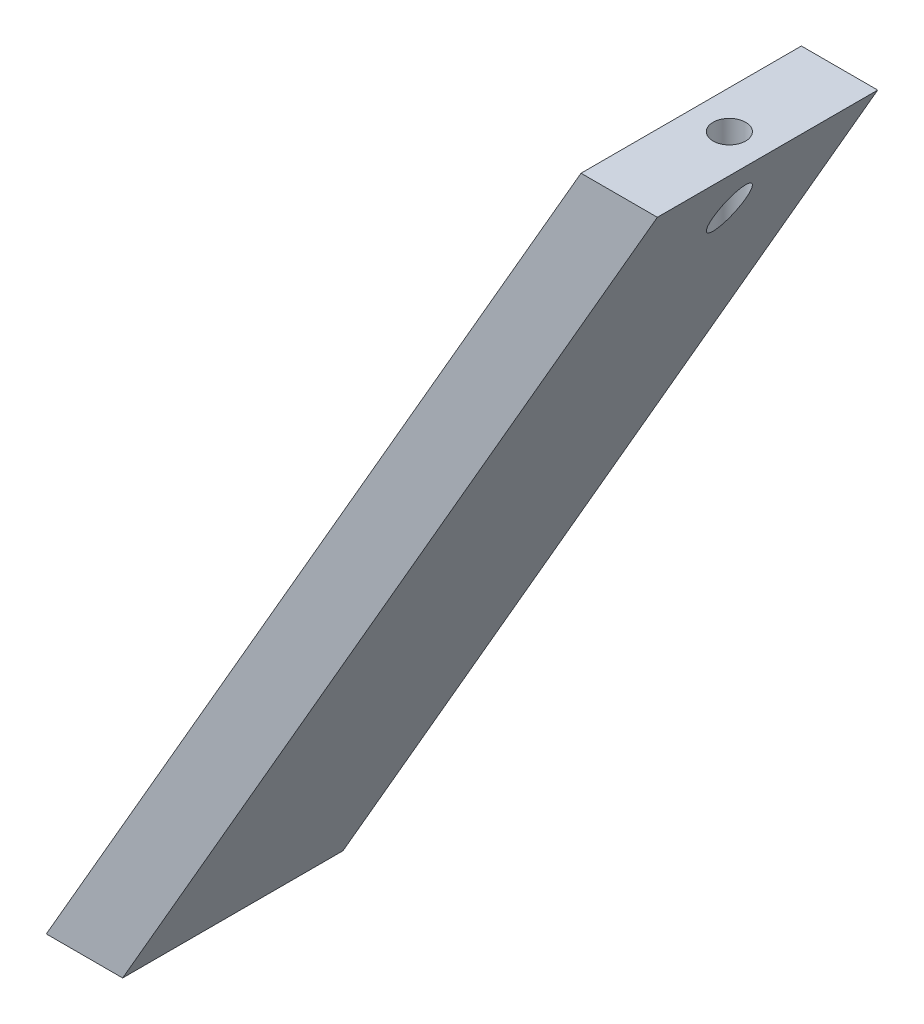
ISO-10303-21;
HEADER;
FILE_DESCRIPTION(('STEP AP214'),'2;1');
FILE_NAME('part.step','',(''),(''),'','','');
FILE_SCHEMA(('AUTOMOTIVE_DESIGN { 1 0 10303 214 1 1 1 1 }'));
ENDSEC;
DATA;
#1=APPLICATION_CONTEXT('core data for automotive mechanical design processes');
#2=APPLICATION_PROTOCOL_DEFINITION('international standard','automotive_design',2000,#1);
#3=PRODUCT_CONTEXT('',#1,'mechanical');
#4=PRODUCT('Part','Part','',(#3));
#5=PRODUCT_RELATED_PRODUCT_CATEGORY('part','',(#4));
#6=PRODUCT_DEFINITION_FORMATION('','',#4);
#7=PRODUCT_DEFINITION_CONTEXT('part definition',#1,'design');
#8=PRODUCT_DEFINITION('design','',#6,#7);
#9=PRODUCT_DEFINITION_SHAPE('','',#8);
#10=(LENGTH_UNIT() NAMED_UNIT(*) SI_UNIT(.MILLI.,.METRE.));
#11=(NAMED_UNIT(*) PLANE_ANGLE_UNIT() SI_UNIT($,.RADIAN.));
#12=(NAMED_UNIT(*) SI_UNIT($,.STERADIAN.) SOLID_ANGLE_UNIT());
#13=UNCERTAINTY_MEASURE_WITH_UNIT(LENGTH_MEASURE(1.E-05),#10,'distance_accuracy_value','');
#14=(GEOMETRIC_REPRESENTATION_CONTEXT(3) GLOBAL_UNCERTAINTY_ASSIGNED_CONTEXT((#13)) GLOBAL_UNIT_ASSIGNED_CONTEXT((#10,
#11,#12)) REPRESENTATION_CONTEXT('',''));
#15=CARTESIAN_POINT('',(0.,0.,0.));
#16=DIRECTION('',(0.,0.,1.));
#17=DIRECTION('',(1.,0.,0.));
#18=AXIS2_PLACEMENT_3D('',#15,#16,#17);
#19=CARTESIAN_POINT('',(-143.102954743875,19.05,63.5));
#20=DIRECTION('',(-0.86602540378444,0.499999999999998,0.));
#21=DIRECTION('',(-0.499999999999998,-0.86602540378444,0.));
#22=AXIS2_PLACEMENT_3D('',#19,#20,#21);
#23=PLANE('',#22);
#24=DIRECTION('',(0.499999999999998,0.86602540378444,0.));
#25=VECTOR('',#24,1.);
#26=CARTESIAN_POINT('',(-143.102954743875,19.05,0.));
#27=LINE('',#26,#25);
#28=CARTESIAN_POINT('',(-143.102954743875,19.05,0.));
#29=VERTEX_POINT('',#28);
#30=CARTESIAN_POINT('',(10.9985226287929,285.961588330889,0.));
#31=VERTEX_POINT('',#30);
#32=EDGE_CURVE('E89',#29,#31,#27,.T.);
#33=ORIENTED_EDGE('',*,*,#32,.T.);
#34=DIRECTION('',(0.,0.,-1.));
#35=VECTOR('',#34,1.);
#36=CARTESIAN_POINT('',(10.9985226287929,285.961588330889,63.5));
#37=LINE('',#36,#35);
#38=CARTESIAN_POINT('',(10.9985226287929,285.961588330889,63.5));
#39=VERTEX_POINT('',#38);
#40=EDGE_CURVE('E42',#39,#31,#37,.T.);
#41=ORIENTED_EDGE('',*,*,#40,.F.);
#42=DIRECTION('',(0.499999999999998,0.86602540378444,0.));
#43=VECTOR('',#42,1.);
#44=CARTESIAN_POINT('',(-143.102954743875,19.05,63.5));
#45=LINE('',#44,#43);
#46=CARTESIAN_POINT('',(-143.102954743875,19.05,63.5));
#47=VERTEX_POINT('',#46);
#48=EDGE_CURVE('E80',#47,#39,#45,.T.);
#49=ORIENTED_EDGE('',*,*,#48,.F.);
#50=DIRECTION('',(0.,0.,-1.));
#51=VECTOR('',#50,1.);
#52=CARTESIAN_POINT('',(-143.102954743875,19.05,63.5));
#53=LINE('',#52,#51);
#54=EDGE_CURVE('E11',#47,#29,#53,.T.);
#55=ORIENTED_EDGE('',*,*,#54,.T.);
#56=EDGE_LOOP('',(#33,#41,#49,#55));
#57=FACE_BOUND('',#56,.T.);
#58=CARTESIAN_POINT('',(0.,266.911588329623,31.75));
#59=DIRECTION('',(-0.86602540378444,0.499999999999998,0.));
#60=DIRECTION('',(-0.499999999999998,-0.86602540378444,0.));
#61=AXIS2_PLACEMENT_3D('',#58,#59,#60);
#62=ELLIPSE('',#61,9.39800000000004,4.699);
#63=CARTESIAN_POINT('',(-4.699,258.772681584857,31.75));
#64=VERTEX_POINT('',#63);
#65=EDGE_CURVE('E101',#64,#64,#62,.F.);
#66=ORIENTED_EDGE('',*,*,#65,.F.);
#67=EDGE_LOOP('',(#66));
#68=FACE_BOUND('',#67,.T.);
#69=ADVANCED_FACE('F33',(#57,#68),#23,.F.);
#70=CARTESIAN_POINT('',(-10.9985226273318,285.961588330889,63.5));
#71=DIRECTION('',(0.,-1.,0.));
#72=DIRECTION('',(0.,0.,-1.));
#73=AXIS2_PLACEMENT_3D('',#70,#71,#72);
#74=PLANE('',#73);
#75=DIRECTION('',(-1.,0.,0.));
#76=VECTOR('',#75,1.);
#77=CARTESIAN_POINT('',(-10.9985226273318,285.961588330889,0.));
#78=LINE('',#77,#76);
#79=CARTESIAN_POINT('',(-10.9985226273318,285.961588330889,0.));
#80=VERTEX_POINT('',#79);
#81=EDGE_CURVE('E67',#31,#80,#78,.T.);
#82=ORIENTED_EDGE('',*,*,#81,.T.);
#83=DIRECTION('',(0.,0.,-1.));
#84=VECTOR('',#83,1.);
#85=CARTESIAN_POINT('',(-10.9985226273318,285.961588330889,63.5));
#86=LINE('',#85,#84);
#87=CARTESIAN_POINT('',(-10.9985226273318,285.961588330889,63.5));
#88=VERTEX_POINT('',#87);
#89=EDGE_CURVE('E90',#88,#80,#86,.T.);
#90=ORIENTED_EDGE('',*,*,#89,.F.);
#91=DIRECTION('',(-1.,0.,0.));
#92=VECTOR('',#91,1.);
#93=CARTESIAN_POINT('',(-10.9985226273318,285.961588330889,63.5));
#94=LINE('',#93,#92);
#95=EDGE_CURVE('E83',#39,#88,#94,.T.);
#96=ORIENTED_EDGE('',*,*,#95,.F.);
#97=ORIENTED_EDGE('',*,*,#40,.T.);
#98=EDGE_LOOP('',(#82,#90,#96,#97));
#99=FACE_BOUND('',#98,.T.);
#100=CARTESIAN_POINT('',(0.,285.961588330889,31.75));
#101=DIRECTION('',(0.,1.,0.));
#102=DIRECTION('',(0.,0.,1.));
#103=AXIS2_PLACEMENT_3D('',#100,#101,#102);
#104=CIRCLE('',#103,4.699);
#105=CARTESIAN_POINT('',(0.,285.961588330889,36.449));
#106=VERTEX_POINT('',#105);
#107=EDGE_CURVE('E114',#106,#106,#104,.T.);
#108=ORIENTED_EDGE('',*,*,#107,.F.);
#109=EDGE_LOOP('',(#108));
#110=FACE_BOUND('',#109,.T.);
#111=ADVANCED_FACE('F91',(#99,#110),#74,.F.);
#112=CARTESIAN_POINT('',(-165.1,19.05,63.5));
#113=DIRECTION('',(0.,1.,0.));
#114=DIRECTION('',(-1.,0.,0.));
#115=AXIS2_PLACEMENT_3D('',#112,#113,#114);
#116=PLANE('',#115);
#117=DIRECTION('',(1.,0.,0.));
#118=VECTOR('',#117,1.);
#119=CARTESIAN_POINT('',(-165.1,19.05,0.));
#120=LINE('',#119,#118);
#121=CARTESIAN_POINT('',(-165.1,19.05,0.));
#122=VERTEX_POINT('',#121);
#123=EDGE_CURVE('E98',#122,#29,#120,.T.);
#124=ORIENTED_EDGE('',*,*,#123,.T.);
#125=ORIENTED_EDGE('',*,*,#54,.F.);
#126=DIRECTION('',(1.,0.,0.));
#127=VECTOR('',#126,1.);
#128=CARTESIAN_POINT('',(-165.1,19.05,63.5));
#129=LINE('',#128,#127);
#130=CARTESIAN_POINT('',(-165.1,19.05,63.5));
#131=VERTEX_POINT('',#130);
#132=EDGE_CURVE('E85',#131,#47,#129,.T.);
#133=ORIENTED_EDGE('',*,*,#132,.F.);
#134=DIRECTION('',(0.,0.,-1.));
#135=VECTOR('',#134,1.);
#136=CARTESIAN_POINT('',(-165.1,19.05,63.5));
#137=LINE('',#136,#135);
#138=EDGE_CURVE('E94',#131,#122,#137,.T.);
#139=ORIENTED_EDGE('',*,*,#138,.T.);
#140=EDGE_LOOP('',(#124,#125,#133,#139));
#141=FACE_BOUND('',#140,.T.);
#142=ADVANCED_FACE('F35',(#141),#116,.F.);
#143=CARTESIAN_POINT('',(-165.1,19.05,63.5));
#144=DIRECTION('',(0.86602540378444,-0.499999999999998,0.));
#145=DIRECTION('',(0.499999999999998,0.86602540378444,0.));
#146=AXIS2_PLACEMENT_3D('',#143,#144,#145);
#147=PLANE('',#146);
#148=DIRECTION('',(-0.499999999999998,-0.86602540378444,0.));
#149=VECTOR('',#148,1.);
#150=CARTESIAN_POINT('',(-165.1,19.05,0.));
#151=LINE('',#150,#149);
#152=EDGE_CURVE('E73',#80,#122,#151,.T.);
#153=ORIENTED_EDGE('',*,*,#152,.T.);
#154=ORIENTED_EDGE('',*,*,#138,.F.);
#155=DIRECTION('',(-0.499999999999998,-0.86602540378444,0.));
#156=VECTOR('',#155,1.);
#157=CARTESIAN_POINT('',(-165.1,19.05,63.5));
#158=LINE('',#157,#156);
#159=EDGE_CURVE('E50',#88,#131,#158,.T.);
#160=ORIENTED_EDGE('',*,*,#159,.F.);
#161=ORIENTED_EDGE('',*,*,#89,.T.);
#162=EDGE_LOOP('',(#153,#154,#160,#161));
#163=FACE_BOUND('',#162,.T.);
#164=ADVANCED_FACE('F106',(#163),#147,.F.);
#165=CARTESIAN_POINT('',(0.,0.,63.5));
#166=DIRECTION('',(0.,0.,1.));
#167=DIRECTION('',(1.,0.,0.));
#168=AXIS2_PLACEMENT_3D('',#165,#166,#167);
#169=PLANE('',#168);
#170=ORIENTED_EDGE('',*,*,#132,.T.);
#171=ORIENTED_EDGE('',*,*,#48,.T.);
#172=ORIENTED_EDGE('',*,*,#95,.T.);
#173=ORIENTED_EDGE('',*,*,#159,.T.);
#174=EDGE_LOOP('',(#170,#171,#172,#173));
#175=FACE_BOUND('',#174,.T.);
#176=ADVANCED_FACE('F81',(#175),#169,.T.);
#177=CARTESIAN_POINT('',(0.,0.,0.));
#178=DIRECTION('',(0.,0.,1.));
#179=DIRECTION('',(1.,0.,0.));
#180=AXIS2_PLACEMENT_3D('',#177,#178,#179);
#181=PLANE('',#180);
#182=ORIENTED_EDGE('',*,*,#123,.F.);
#183=ORIENTED_EDGE('',*,*,#152,.F.);
#184=ORIENTED_EDGE('',*,*,#81,.F.);
#185=ORIENTED_EDGE('',*,*,#32,.F.);
#186=EDGE_LOOP('',(#182,#183,#184,#185));
#187=FACE_BOUND('',#186,.T.);
#188=ADVANCED_FACE('F109',(#187),#181,.F.);
#189=CARTESIAN_POINT('',(0.,285.961588330889,31.75));
#190=DIRECTION('',(0.,-1.,0.));
#191=DIRECTION('',(0.,0.,-1.));
#192=AXIS2_PLACEMENT_3D('',#189,#190,#191);
#193=CYLINDRICAL_SURFACE('',#192,4.699);
#194=ORIENTED_EDGE('',*,*,#107,.T.);
#195=EDGE_LOOP('',(#194));
#196=FACE_BOUND('',#195,.T.);
#197=ORIENTED_EDGE('',*,*,#65,.T.);
#198=EDGE_LOOP('',(#197));
#199=FACE_BOUND('',#198,.T.);
#200=ADVANCED_FACE('F118',(#196,#199),#193,.F.);
#201=CLOSED_SHELL('',(#69,#111,#142,#164,#176,#188,#200));
#202=MANIFOLD_SOLID_BREP('B2',#201);
#203=ADVANCED_BREP_SHAPE_REPRESENTATION('',(#18,#202),#14);
#204=SHAPE_DEFINITION_REPRESENTATION(#9,#203);
ENDSEC;
END-ISO-10303-21;
